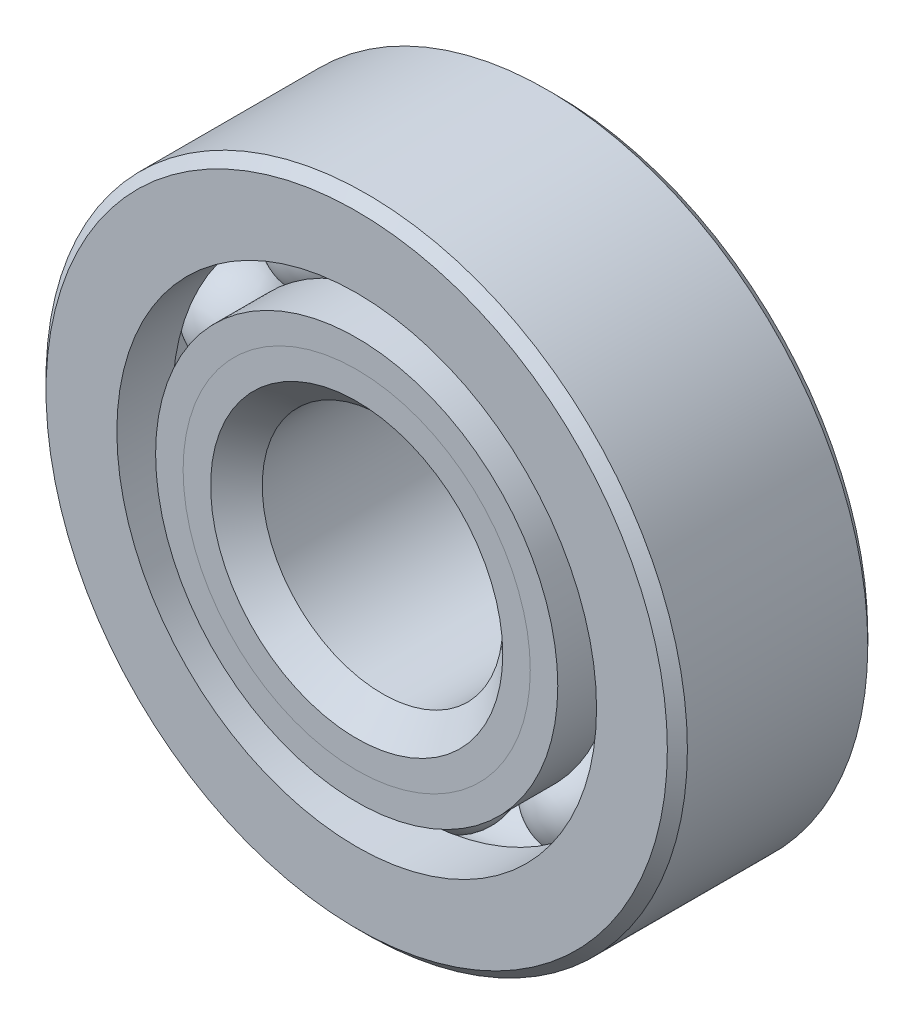
ISO-10303-21;
HEADER;
FILE_DESCRIPTION(('STEP AP214'),'2;1');
FILE_NAME('part.step','',(''),(''),'','','');
FILE_SCHEMA(('AUTOMOTIVE_DESIGN { 1 0 10303 214 1 1 1 1 }'));
ENDSEC;
DATA;
#1=APPLICATION_CONTEXT('core data for automotive mechanical design processes');
#2=APPLICATION_PROTOCOL_DEFINITION('international standard','automotive_design',2000,#1);
#3=PRODUCT_CONTEXT('',#1,'mechanical');
#4=PRODUCT('Part','Part','',(#3));
#5=PRODUCT_RELATED_PRODUCT_CATEGORY('part','',(#4));
#6=PRODUCT_DEFINITION_FORMATION('','',#4);
#7=PRODUCT_DEFINITION_CONTEXT('part definition',#1,'design');
#8=PRODUCT_DEFINITION('design','',#6,#7);
#9=PRODUCT_DEFINITION_SHAPE('','',#8);
#10=(LENGTH_UNIT() NAMED_UNIT(*) SI_UNIT(.MILLI.,.METRE.));
#11=(NAMED_UNIT(*) PLANE_ANGLE_UNIT() SI_UNIT($,.RADIAN.));
#12=(NAMED_UNIT(*) SI_UNIT($,.STERADIAN.) SOLID_ANGLE_UNIT());
#13=UNCERTAINTY_MEASURE_WITH_UNIT(LENGTH_MEASURE(1.E-05),#10,'distance_accuracy_value','');
#14=(GEOMETRIC_REPRESENTATION_CONTEXT(3) GLOBAL_UNCERTAINTY_ASSIGNED_CONTEXT((#13)) GLOBAL_UNIT_ASSIGNED_CONTEXT((#10,
#11,#12)) REPRESENTATION_CONTEXT('',''));
#15=CARTESIAN_POINT('',(0.,0.,0.));
#16=DIRECTION('',(0.,0.,1.));
#17=DIRECTION('',(1.,0.,0.));
#18=AXIS2_PLACEMENT_3D('',#15,#16,#17);
#19=CARTESIAN_POINT('',(-2.56604999203928,3.53186481606816,0.));
#20=DIRECTION('',(0.,0.,1.));
#21=DIRECTION('',(-0.587785252292462,0.809016994374955,0.));
#22=AXIS2_PLACEMENT_3D('',#19,#20,#21);
#23=SPHERICAL_SURFACE('',#22,0.961832467237322);
#24=CARTESIAN_POINT('',(-2.56604999203928,3.53186481606816,0.96183246723732));
#25=VERTEX_POINT('',#24);
#26=VERTEX_LOOP('',#25);
#27=FACE_BOUND('',#26,.T.);
#28=ADVANCED_FACE('F39',(#27),#23,.T.);
#29=CLOSED_SHELL('',(#28));
#30=MANIFOLD_SOLID_BREP('B2',#29);
#31=CARTESIAN_POINT('',(-4.15195610395102,1.34905231606818,0.));
#32=DIRECTION('',(0.,0.,1.));
#33=DIRECTION('',(-0.95105651629515,0.309016994374958,0.));
#34=AXIS2_PLACEMENT_3D('',#31,#32,#33);
#35=SPHERICAL_SURFACE('',#34,0.961832467237322);
#36=CARTESIAN_POINT('',(-4.15195610395102,1.34905231606818,0.96183246723732));
#37=VERTEX_POINT('',#36);
#38=VERTEX_LOOP('',#37);
#39=FACE_BOUND('',#38,.T.);
#40=ADVANCED_FACE('F72',(#39),#35,.T.);
#41=CLOSED_SHELL('',(#40));
#42=MANIFOLD_SOLID_BREP('B6',#41);
#43=CARTESIAN_POINT('',(-4.15195610395104,-1.34905231606809,0.));
#44=DIRECTION('',(0.,0.,1.));
#45=DIRECTION('',(-0.951056516295157,-0.309016994374938,0.));
#46=AXIS2_PLACEMENT_3D('',#43,#44,#45);
#47=SPHERICAL_SURFACE('',#46,0.961832467237322);
#48=CARTESIAN_POINT('',(-4.15195610395104,-1.34905231606809,0.96183246723732));
#49=VERTEX_POINT('',#48);
#50=VERTEX_LOOP('',#49);
#51=FACE_BOUND('',#50,.T.);
#52=ADVANCED_FACE('F105',(#51),#47,.T.);
#53=CLOSED_SHELL('',(#52));
#54=MANIFOLD_SOLID_BREP('B35',#53);
#55=CARTESIAN_POINT('',(-2.56604999203936,-3.53186481606811,0.));
#56=DIRECTION('',(0.,0.,1.));
#57=DIRECTION('',(-0.58778525229248,-0.809016994374942,0.));
#58=AXIS2_PLACEMENT_3D('',#55,#56,#57);
#59=SPHERICAL_SURFACE('',#58,0.961832467237322);
#60=CARTESIAN_POINT('',(-2.56604999203936,-3.53186481606811,0.96183246723732));
#61=VERTEX_POINT('',#60);
#62=VERTEX_LOOP('',#61);
#63=FACE_BOUND('',#62,.T.);
#64=ADVANCED_FACE('F138',(#63),#59,.T.);
#65=CLOSED_SHELL('',(#64));
#66=MANIFOLD_SOLID_BREP('B68',#65);
#67=CARTESIAN_POINT('',(0.,-4.365625,0.));
#68=DIRECTION('',(0.,0.,1.));
#69=DIRECTION('',(0.,-1.,0.));
#70=AXIS2_PLACEMENT_3D('',#67,#68,#69);
#71=SPHERICAL_SURFACE('',#70,0.961832467237322);
#72=CARTESIAN_POINT('',(0.,-4.365625,0.96183246723732));
#73=VERTEX_POINT('',#72);
#74=VERTEX_LOOP('',#73);
#75=FACE_BOUND('',#74,.T.);
#76=ADVANCED_FACE('F171',(#75),#71,.T.);
#77=CLOSED_SHELL('',(#76));
#78=MANIFOLD_SOLID_BREP('B101',#77);
#79=CARTESIAN_POINT('',(2.56604999203931,-3.53186481606815,0.));
#80=DIRECTION('',(0.,0.,1.));
#81=DIRECTION('',(0.587785252292469,-0.809016994374951,0.));
#82=AXIS2_PLACEMENT_3D('',#79,#80,#81);
#83=SPHERICAL_SURFACE('',#82,0.961832467237322);
#84=CARTESIAN_POINT('',(2.56604999203931,-3.53186481606815,0.96183246723732));
#85=VERTEX_POINT('',#84);
#86=VERTEX_LOOP('',#85);
#87=FACE_BOUND('',#86,.T.);
#88=ADVANCED_FACE('F204',(#87),#83,.T.);
#89=CLOSED_SHELL('',(#88));
#90=MANIFOLD_SOLID_BREP('B134',#89);
#91=CARTESIAN_POINT('',(4.15195610395103,-1.34905231606815,0.));
#92=DIRECTION('',(0.,0.,1.));
#93=DIRECTION('',(0.951056516295152,-0.309016994374952,0.));
#94=AXIS2_PLACEMENT_3D('',#91,#92,#93);
#95=SPHERICAL_SURFACE('',#94,0.961832467237322);
#96=CARTESIAN_POINT('',(4.15195610395103,-1.34905231606815,0.96183246723732));
#97=VERTEX_POINT('',#96);
#98=VERTEX_LOOP('',#97);
#99=FACE_BOUND('',#98,.T.);
#100=ADVANCED_FACE('F237',(#99),#95,.T.);
#101=CLOSED_SHELL('',(#100));
#102=MANIFOLD_SOLID_BREP('B167',#101);
#103=CARTESIAN_POINT('',(4.15195610395104,1.34905231606812,0.));
#104=DIRECTION('',(0.,0.,1.));
#105=DIRECTION('',(0.951056516295155,0.309016994374945,0.));
#106=AXIS2_PLACEMENT_3D('',#103,#104,#105);
#107=SPHERICAL_SURFACE('',#106,0.961832467237322);
#108=CARTESIAN_POINT('',(4.15195610395104,1.34905231606812,0.96183246723732));
#109=VERTEX_POINT('',#108);
#110=VERTEX_LOOP('',#109);
#111=FACE_BOUND('',#110,.T.);
#112=ADVANCED_FACE('F270',(#111),#107,.T.);
#113=CLOSED_SHELL('',(#112));
#114=MANIFOLD_SOLID_BREP('B200',#113);
#115=CARTESIAN_POINT('',(2.56604999203933,3.53186481606813,0.));
#116=DIRECTION('',(0.,0.,1.));
#117=DIRECTION('',(0.587785252292474,0.809016994374947,0.));
#118=AXIS2_PLACEMENT_3D('',#115,#116,#117);
#119=SPHERICAL_SURFACE('',#118,0.961832467237322);
#120=CARTESIAN_POINT('',(2.56604999203933,3.53186481606813,0.96183246723732));
#121=VERTEX_POINT('',#120);
#122=VERTEX_LOOP('',#121);
#123=FACE_BOUND('',#122,.T.);
#124=ADVANCED_FACE('F303',(#123),#119,.T.);
#125=CLOSED_SHELL('',(#124));
#126=MANIFOLD_SOLID_BREP('B233',#125);
#127=CARTESIAN_POINT('',(0.,4.365625,0.));
#128=DIRECTION('',(0.,0.,1.));
#129=DIRECTION('',(0.,1.,0.));
#130=AXIS2_PLACEMENT_3D('',#127,#128,#129);
#131=SPHERICAL_SURFACE('',#130,0.961832467237322);
#132=CARTESIAN_POINT('',(0.,4.365625,0.96183246723732));
#133=VERTEX_POINT('',#132);
#134=VERTEX_LOOP('',#133);
#135=FACE_BOUND('',#134,.T.);
#136=ADVANCED_FACE('F338',(#135),#131,.T.);
#137=CLOSED_SHELL('',(#136));
#138=MANIFOLD_SOLID_BREP('B266',#137);
#139=CARTESIAN_POINT('',(0.,3.43717752879507,1.984375));
#140=DIRECTION('',(0.,0.,-1.));
#141=DIRECTION('',(-1.,0.,0.));
#142=AXIS2_PLACEMENT_3D('',#139,#140,#141);
#143=PLANE('',#142);
#144=CARTESIAN_POINT('',(0.,0.,1.984375));
#145=DIRECTION('',(0.,0.,1.));
#146=DIRECTION('',(1.,0.,0.));
#147=AXIS2_PLACEMENT_3D('',#144,#145,#146);
#148=CIRCLE('',#147,2.89252126638134);
#149=CARTESIAN_POINT('',(2.89252126638134,0.,1.984375));
#150=VERTEX_POINT('',#149);
#151=EDGE_CURVE('E392',#150,#150,#148,.T.);
#152=ORIENTED_EDGE('',*,*,#151,.F.);
#153=EDGE_LOOP('',(#152));
#154=FACE_BOUND('',#153,.T.);
#155=CARTESIAN_POINT('',(0.,0.,1.984375));
#156=DIRECTION('',(0.,0.,1.));
#157=DIRECTION('',(1.,0.,0.));
#158=AXIS2_PLACEMENT_3D('',#155,#156,#157);
#159=CIRCLE('',#158,3.43717752879507);
#160=CARTESIAN_POINT('',(3.43717752879507,0.,1.984375));
#161=VERTEX_POINT('',#160);
#162=EDGE_CURVE('E337',#161,#161,#159,.T.);
#163=ORIENTED_EDGE('',*,*,#162,.T.);
#164=EDGE_LOOP('',(#163));
#165=FACE_BOUND('',#164,.T.);
#166=ADVANCED_FACE('F358',(#154,#165),#143,.F.);
#167=CARTESIAN_POINT('',(0.,0.,1.43971873758627));
#168=DIRECTION('',(0.,0.,1.));
#169=DIRECTION('',(1.,0.,0.));
#170=AXIS2_PLACEMENT_3D('',#167,#168,#169);
#171=CONICAL_SURFACE('',#170,2.89252126638134,0.785398163397451);
#172=ORIENTED_EDGE('',*,*,#162,.F.);
#173=EDGE_LOOP('',(#172));
#174=FACE_BOUND('',#173,.T.);
#175=CARTESIAN_POINT('',(0.,0.,1.43971873758627));
#176=DIRECTION('',(0.,0.,1.));
#177=DIRECTION('',(1.,0.,0.));
#178=AXIS2_PLACEMENT_3D('',#175,#176,#177);
#179=CIRCLE('',#178,2.89252126638134);
#180=CARTESIAN_POINT('',(2.89252126638134,0.,1.43971873758627));
#181=VERTEX_POINT('',#180);
#182=EDGE_CURVE('E364',#181,#181,#179,.T.);
#183=ORIENTED_EDGE('',*,*,#182,.T.);
#184=EDGE_LOOP('',(#183));
#185=FACE_BOUND('',#184,.T.);
#186=ADVANCED_FACE('F399',(#174,#185),#171,.T.);
#187=CARTESIAN_POINT('',(0.,0.,1.984375));
#188=DIRECTION('',(0.,0.,1.));
#189=DIRECTION('',(1.,0.,0.));
#190=AXIS2_PLACEMENT_3D('',#187,#188,#189);
#191=CYLINDRICAL_SURFACE('',#190,2.89252126638134);
#192=ORIENTED_EDGE('',*,*,#182,.F.);
#193=EDGE_LOOP('',(#192));
#194=FACE_BOUND('',#193,.T.);
#195=CARTESIAN_POINT('',(0.,0.,0.));
#196=DIRECTION('',(0.,0.,1.));
#197=DIRECTION('',(1.,0.,0.));
#198=AXIS2_PLACEMENT_3D('',#195,#196,#197);
#199=CIRCLE('',#198,2.89252126638134);
#200=CARTESIAN_POINT('',(2.89252126638134,0.,0.));
#201=VERTEX_POINT('',#200);
#202=EDGE_CURVE('E368',#201,#201,#199,.T.);
#203=ORIENTED_EDGE('',*,*,#202,.T.);
#204=EDGE_LOOP('',(#203));
#205=FACE_BOUND('',#204,.T.);
#206=ADVANCED_FACE('F403',(#194,#205),#191,.T.);
#207=CARTESIAN_POINT('',(0.,2.89252126638134,0.));
#208=DIRECTION('',(0.,0.,-1.));
#209=DIRECTION('',(-1.,0.,0.));
#210=AXIS2_PLACEMENT_3D('',#207,#208,#209);
#211=PLANE('',#210);
#212=ORIENTED_EDGE('',*,*,#202,.F.);
#213=EDGE_LOOP('',(#212));
#214=FACE_BOUND('',#213,.T.);
#215=CARTESIAN_POINT('',(0.,0.,0.));
#216=DIRECTION('',(0.,0.,1.));
#217=DIRECTION('',(1.,0.,0.));
#218=AXIS2_PLACEMENT_3D('',#215,#216,#217);
#219=CIRCLE('',#218,3.40379253276268);
#220=CARTESIAN_POINT('',(3.40379253276268,0.,0.));
#221=VERTEX_POINT('',#220);
#222=EDGE_CURVE('E372',#221,#221,#219,.T.);
#223=ORIENTED_EDGE('',*,*,#222,.T.);
#224=EDGE_LOOP('',(#223));
#225=FACE_BOUND('',#224,.T.);
#226=ADVANCED_FACE('F408',(#214,#225),#211,.F.);
#227=CARTESIAN_POINT('',(0.,0.,0.));
#228=DIRECTION('',(0.,0.,1.));
#229=DIRECTION('',(1.,0.,0.));
#230=AXIS2_PLACEMENT_3D('',#227,#228,#229);
#231=TOROIDAL_SURFACE('',#230,4.365625,0.96183246723732);
#232=ORIENTED_EDGE('',*,*,#222,.F.);
#233=EDGE_LOOP('',(#232));
#234=FACE_BOUND('',#233,.T.);
#235=CARTESIAN_POINT('',(0.,0.,-0.881944444444445));
#236=DIRECTION('',(0.,0.,1.));
#237=DIRECTION('',(1.,0.,0.));
#238=AXIS2_PLACEMENT_3D('',#235,#236,#237);
#239=CIRCLE('',#238,3.9818337912088);
#240=CARTESIAN_POINT('',(3.9818337912088,0.,-0.881944444444445));
#241=VERTEX_POINT('',#240);
#242=EDGE_CURVE('E377',#241,#241,#239,.T.);
#243=ORIENTED_EDGE('',*,*,#242,.T.);
#244=EDGE_LOOP('',(#243));
#245=FACE_BOUND('',#244,.T.);
#246=ADVANCED_FACE('F414',(#234,#245),#231,.F.);
#247=CARTESIAN_POINT('',(0.,0.,1.984375));
#248=DIRECTION('',(0.,0.,1.));
#249=DIRECTION('',(1.,0.,0.));
#250=AXIS2_PLACEMENT_3D('',#247,#248,#249);
#251=CYLINDRICAL_SURFACE('',#250,3.9818337912088);
#252=ORIENTED_EDGE('',*,*,#242,.F.);
#253=EDGE_LOOP('',(#252));
#254=FACE_BOUND('',#253,.T.);
#255=CARTESIAN_POINT('',(0.,0.,-1.98437500000001));
#256=DIRECTION('',(0.,0.,1.));
#257=DIRECTION('',(1.,0.,0.));
#258=AXIS2_PLACEMENT_3D('',#255,#256,#257);
#259=CIRCLE('',#258,3.9818337912088);
#260=CARTESIAN_POINT('',(3.9818337912088,0.,-1.98437500000001));
#261=VERTEX_POINT('',#260);
#262=EDGE_CURVE('E380',#261,#261,#259,.T.);
#263=ORIENTED_EDGE('',*,*,#262,.T.);
#264=EDGE_LOOP('',(#263));
#265=FACE_BOUND('',#264,.T.);
#266=ADVANCED_FACE('F418',(#254,#265),#251,.T.);
#267=CARTESIAN_POINT('',(0.,2.5796875,-1.98437500000001));
#268=DIRECTION('',(0.,0.,1.));
#269=DIRECTION('',(1.,0.,0.));
#270=AXIS2_PLACEMENT_3D('',#267,#268,#269);
#271=PLANE('',#270);
#272=ORIENTED_EDGE('',*,*,#262,.F.);
#273=EDGE_LOOP('',(#272));
#274=FACE_BOUND('',#273,.T.);
#275=CARTESIAN_POINT('',(0.,0.,-1.98437500000001));
#276=DIRECTION('',(0.,0.,1.));
#277=DIRECTION('',(1.,0.,0.));
#278=AXIS2_PLACEMENT_3D('',#275,#276,#277);
#279=CIRCLE('',#278,2.5796875);
#280=CARTESIAN_POINT('',(2.5796875,0.,-1.98437500000001));
#281=VERTEX_POINT('',#280);
#282=EDGE_CURVE('E383',#281,#281,#279,.T.);
#283=ORIENTED_EDGE('',*,*,#282,.T.);
#284=EDGE_LOOP('',(#283));
#285=FACE_BOUND('',#284,.T.);
#286=ADVANCED_FACE('F422',(#274,#285),#271,.F.);
#287=CARTESIAN_POINT('',(0.,0.,-1.78593750000001));
#288=DIRECTION('',(0.,0.,-1.));
#289=DIRECTION('',(-1.,0.,0.));
#290=AXIS2_PLACEMENT_3D('',#287,#288,#289);
#291=CONICAL_SURFACE('',#290,2.38125,0.785398163397446);
#292=ORIENTED_EDGE('',*,*,#282,.F.);
#293=EDGE_LOOP('',(#292));
#294=FACE_BOUND('',#293,.T.);
#295=CARTESIAN_POINT('',(0.,0.,-1.78593750000001));
#296=DIRECTION('',(0.,0.,1.));
#297=DIRECTION('',(1.,0.,0.));
#298=AXIS2_PLACEMENT_3D('',#295,#296,#297);
#299=CIRCLE('',#298,2.38125);
#300=CARTESIAN_POINT('',(2.38125,0.,-1.78593750000001));
#301=VERTEX_POINT('',#300);
#302=EDGE_CURVE('E386',#301,#301,#299,.T.);
#303=ORIENTED_EDGE('',*,*,#302,.T.);
#304=EDGE_LOOP('',(#303));
#305=FACE_BOUND('',#304,.T.);
#306=ADVANCED_FACE('F426',(#294,#305),#291,.F.);
#307=CARTESIAN_POINT('',(0.,0.,1.984375));
#308=DIRECTION('',(0.,0.,1.));
#309=DIRECTION('',(1.,0.,0.));
#310=AXIS2_PLACEMENT_3D('',#307,#308,#309);
#311=CYLINDRICAL_SURFACE('',#310,2.38125);
#312=ORIENTED_EDGE('',*,*,#302,.F.);
#313=EDGE_LOOP('',(#312));
#314=FACE_BOUND('',#313,.T.);
#315=CARTESIAN_POINT('',(0.,0.,1.47310373361866));
#316=DIRECTION('',(0.,0.,1.));
#317=DIRECTION('',(1.,0.,0.));
#318=AXIS2_PLACEMENT_3D('',#315,#316,#317);
#319=CIRCLE('',#318,2.38125);
#320=CARTESIAN_POINT('',(2.38125,0.,1.47310373361866));
#321=VERTEX_POINT('',#320);
#322=EDGE_CURVE('E389',#321,#321,#319,.T.);
#323=ORIENTED_EDGE('',*,*,#322,.T.);
#324=EDGE_LOOP('',(#323));
#325=FACE_BOUND('',#324,.T.);
#326=ADVANCED_FACE('F430',(#314,#325),#311,.F.);
#327=CARTESIAN_POINT('',(0.,0.,1.984375));
#328=DIRECTION('',(0.,0.,1.));
#329=DIRECTION('',(1.,0.,0.));
#330=AXIS2_PLACEMENT_3D('',#327,#328,#329);
#331=CONICAL_SURFACE('',#330,2.89252126638134,0.785398163397451);
#332=ORIENTED_EDGE('',*,*,#322,.F.);
#333=EDGE_LOOP('',(#332));
#334=FACE_BOUND('',#333,.T.);
#335=ORIENTED_EDGE('',*,*,#151,.T.);
#336=EDGE_LOOP('',(#335));
#337=FACE_BOUND('',#336,.T.);
#338=ADVANCED_FACE('F396',(#334,#337),#331,.F.);
#339=CLOSED_SHELL('',(#166,#186,#206,#226,#246,#266,#286,#306,#326,#338));
#340=MANIFOLD_SOLID_BREP('B299',#339);
#341=CARTESIAN_POINT('',(0.,3.9818337912088,1.984375));
#342=DIRECTION('',(0.,0.,-1.));
#343=DIRECTION('',(-1.,0.,0.));
#344=AXIS2_PLACEMENT_3D('',#341,#342,#343);
#345=PLANE('',#344);
#346=CARTESIAN_POINT('',(0.,0.,1.984375));
#347=DIRECTION('',(0.,0.,1.));
#348=DIRECTION('',(1.,0.,0.));
#349=AXIS2_PLACEMENT_3D('',#346,#347,#348);
#350=CIRCLE('',#349,3.43717752879507);
#351=CARTESIAN_POINT('',(3.43717752879507,0.,1.984375));
#352=VERTEX_POINT('',#351);
#353=EDGE_CURVE('E357',#352,#352,#350,.T.);
#354=ORIENTED_EDGE('',*,*,#353,.F.);
#355=EDGE_LOOP('',(#354));
#356=FACE_BOUND('',#355,.T.);
#357=CARTESIAN_POINT('',(0.,0.,1.984375));
#358=DIRECTION('',(0.,0.,1.));
#359=DIRECTION('',(1.,0.,0.));
#360=AXIS2_PLACEMENT_3D('',#357,#358,#359);
#361=CIRCLE('',#360,3.9818337912088);
#362=CARTESIAN_POINT('',(3.9818337912088,0.,1.984375));
#363=VERTEX_POINT('',#362);
#364=EDGE_CURVE('E538',#363,#363,#361,.T.);
#365=ORIENTED_EDGE('',*,*,#364,.T.);
#366=EDGE_LOOP('',(#365));
#367=FACE_BOUND('',#366,.T.);
#368=ADVANCED_FACE('F516',(#356,#367),#345,.F.);
#369=CARTESIAN_POINT('',(0.,0.,1.984375));
#370=DIRECTION('',(0.,0.,1.));
#371=DIRECTION('',(1.,0.,0.));
#372=AXIS2_PLACEMENT_3D('',#369,#370,#371);
#373=CONICAL_SURFACE('',#372,3.43717752879507,0.785398163397451);
#374=CARTESIAN_POINT('',(0.,0.,1.43971873758627));
#375=DIRECTION('',(0.,0.,1.));
#376=DIRECTION('',(1.,0.,0.));
#377=AXIS2_PLACEMENT_3D('',#374,#375,#376);
#378=CIRCLE('',#377,2.89252126638134);
#379=CARTESIAN_POINT('',(2.89252126638134,0.,1.43971873758627));
#380=VERTEX_POINT('',#379);
#381=EDGE_CURVE('E522',#380,#380,#378,.T.);
#382=ORIENTED_EDGE('',*,*,#381,.F.);
#383=EDGE_LOOP('',(#382));
#384=FACE_BOUND('',#383,.T.);
#385=ORIENTED_EDGE('',*,*,#353,.T.);
#386=EDGE_LOOP('',(#385));
#387=FACE_BOUND('',#386,.T.);
#388=ADVANCED_FACE('F563',(#384,#387),#373,.F.);
#389=CARTESIAN_POINT('',(0.,0.,1.984375));
#390=DIRECTION('',(0.,0.,1.));
#391=DIRECTION('',(1.,0.,0.));
#392=AXIS2_PLACEMENT_3D('',#389,#390,#391);
#393=CYLINDRICAL_SURFACE('',#392,2.89252126638134);
#394=CARTESIAN_POINT('',(0.,0.,0.));
#395=DIRECTION('',(0.,0.,1.));
#396=DIRECTION('',(1.,0.,0.));
#397=AXIS2_PLACEMENT_3D('',#394,#395,#396);
#398=CIRCLE('',#397,2.89252126638134);
#399=CARTESIAN_POINT('',(2.89252126638134,0.,0.));
#400=VERTEX_POINT('',#399);
#401=EDGE_CURVE('E526',#400,#400,#398,.T.);
#402=ORIENTED_EDGE('',*,*,#401,.F.);
#403=EDGE_LOOP('',(#402));
#404=FACE_BOUND('',#403,.T.);
#405=ORIENTED_EDGE('',*,*,#381,.T.);
#406=EDGE_LOOP('',(#405));
#407=FACE_BOUND('',#406,.T.);
#408=ADVANCED_FACE('F558',(#404,#407),#393,.F.);
#409=CARTESIAN_POINT('',(0.,2.89252126638134,0.));
#410=DIRECTION('',(0.,0.,1.));
#411=DIRECTION('',(1.,0.,0.));
#412=AXIS2_PLACEMENT_3D('',#409,#410,#411);
#413=PLANE('',#412);
#414=CARTESIAN_POINT('',(0.,0.,0.));
#415=DIRECTION('',(0.,0.,1.));
#416=DIRECTION('',(1.,0.,0.));
#417=AXIS2_PLACEMENT_3D('',#414,#415,#416);
#418=CIRCLE('',#417,3.40379253276268);
#419=CARTESIAN_POINT('',(3.40379253276268,0.,0.));
#420=VERTEX_POINT('',#419);
#421=EDGE_CURVE('E530',#420,#420,#418,.T.);
#422=ORIENTED_EDGE('',*,*,#421,.F.);
#423=EDGE_LOOP('',(#422));
#424=FACE_BOUND('',#423,.T.);
#425=ORIENTED_EDGE('',*,*,#401,.T.);
#426=EDGE_LOOP('',(#425));
#427=FACE_BOUND('',#426,.T.);
#428=ADVANCED_FACE('F552',(#424,#427),#413,.F.);
#429=CARTESIAN_POINT('',(0.,0.,0.));
#430=DIRECTION('',(0.,0.,1.));
#431=DIRECTION('',(1.,0.,0.));
#432=AXIS2_PLACEMENT_3D('',#429,#430,#431);
#433=TOROIDAL_SURFACE('',#432,4.365625,0.961832467237322);
#434=CARTESIAN_POINT('',(0.,0.,0.881944444444442));
#435=DIRECTION('',(0.,0.,1.));
#436=DIRECTION('',(1.,0.,0.));
#437=AXIS2_PLACEMENT_3D('',#434,#435,#436);
#438=CIRCLE('',#437,3.9818337912088);
#439=CARTESIAN_POINT('',(3.9818337912088,0.,0.881944444444442));
#440=VERTEX_POINT('',#439);
#441=EDGE_CURVE('E535',#440,#440,#438,.T.);
#442=ORIENTED_EDGE('',*,*,#441,.F.);
#443=EDGE_LOOP('',(#442));
#444=FACE_BOUND('',#443,.T.);
#445=ORIENTED_EDGE('',*,*,#421,.T.);
#446=EDGE_LOOP('',(#445));
#447=FACE_BOUND('',#446,.T.);
#448=ADVANCED_FACE('F546',(#444,#447),#433,.F.);
#449=CARTESIAN_POINT('',(0.,0.,1.984375));
#450=DIRECTION('',(0.,0.,1.));
#451=DIRECTION('',(1.,0.,0.));
#452=AXIS2_PLACEMENT_3D('',#449,#450,#451);
#453=CYLINDRICAL_SURFACE('',#452,3.9818337912088);
#454=ORIENTED_EDGE('',*,*,#364,.F.);
#455=EDGE_LOOP('',(#454));
#456=FACE_BOUND('',#455,.T.);
#457=ORIENTED_EDGE('',*,*,#441,.T.);
#458=EDGE_LOOP('',(#457));
#459=FACE_BOUND('',#458,.T.);
#460=ADVANCED_FACE('F543',(#456,#459),#453,.T.);
#461=CLOSED_SHELL('',(#368,#388,#408,#428,#448,#460));
#462=MANIFOLD_SOLID_BREP('B332',#461);
#463=CARTESIAN_POINT('',(0.,0.,1.7859375));
#464=DIRECTION('',(0.,0.,-1.));
#465=DIRECTION('',(-1.,0.,0.));
#466=AXIS2_PLACEMENT_3D('',#463,#464,#465);
#467=CONICAL_SURFACE('',#466,6.35,0.785398163397447);
#468=CARTESIAN_POINT('',(0.,0.,1.984375));
#469=DIRECTION('',(0.,0.,1.));
#470=DIRECTION('',(1.,0.,0.));
#471=AXIS2_PLACEMENT_3D('',#468,#469,#470);
#472=CIRCLE('',#471,6.1515625);
#473=CARTESIAN_POINT('',(6.1515625,0.,1.984375));
#474=VERTEX_POINT('',#473);
#475=EDGE_CURVE('E635',#474,#474,#472,.T.);
#476=ORIENTED_EDGE('',*,*,#475,.F.);
#477=EDGE_LOOP('',(#476));
#478=FACE_BOUND('',#477,.T.);
#479=CARTESIAN_POINT('',(0.,0.,1.7859375));
#480=DIRECTION('',(0.,0.,1.));
#481=DIRECTION('',(1.,0.,0.));
#482=AXIS2_PLACEMENT_3D('',#479,#480,#481);
#483=CIRCLE('',#482,6.35);
#484=CARTESIAN_POINT('',(6.35,0.,1.7859375));
#485=VERTEX_POINT('',#484);
#486=EDGE_CURVE('E515',#485,#485,#483,.T.);
#487=ORIENTED_EDGE('',*,*,#486,.T.);
#488=EDGE_LOOP('',(#487));
#489=FACE_BOUND('',#488,.T.);
#490=ADVANCED_FACE('F607',(#478,#489),#467,.T.);
#491=CARTESIAN_POINT('',(0.,0.,1.984375));
#492=DIRECTION('',(0.,0.,1.));
#493=DIRECTION('',(1.,0.,0.));
#494=AXIS2_PLACEMENT_3D('',#491,#492,#493);
#495=CYLINDRICAL_SURFACE('',#494,6.35);
#496=ORIENTED_EDGE('',*,*,#486,.F.);
#497=EDGE_LOOP('',(#496));
#498=FACE_BOUND('',#497,.T.);
#499=CARTESIAN_POINT('',(0.,0.,-1.78593750000001));
#500=DIRECTION('',(0.,0.,1.));
#501=DIRECTION('',(1.,0.,0.));
#502=AXIS2_PLACEMENT_3D('',#499,#500,#501);
#503=CIRCLE('',#502,6.35);
#504=CARTESIAN_POINT('',(6.35,0.,-1.78593750000001));
#505=VERTEX_POINT('',#504);
#506=EDGE_CURVE('E613',#505,#505,#503,.T.);
#507=ORIENTED_EDGE('',*,*,#506,.T.);
#508=EDGE_LOOP('',(#507));
#509=FACE_BOUND('',#508,.T.);
#510=ADVANCED_FACE('F642',(#498,#509),#495,.T.);
#511=CARTESIAN_POINT('',(0.,0.,-1.98437500000001));
#512=DIRECTION('',(0.,0.,1.));
#513=DIRECTION('',(1.,0.,0.));
#514=AXIS2_PLACEMENT_3D('',#511,#512,#513);
#515=CONICAL_SURFACE('',#514,6.1515625,0.785398163397446);
#516=ORIENTED_EDGE('',*,*,#506,.F.);
#517=EDGE_LOOP('',(#516));
#518=FACE_BOUND('',#517,.T.);
#519=CARTESIAN_POINT('',(0.,0.,-1.98437500000001));
#520=DIRECTION('',(0.,0.,1.));
#521=DIRECTION('',(1.,0.,0.));
#522=AXIS2_PLACEMENT_3D('',#519,#520,#521);
#523=CIRCLE('',#522,6.1515625);
#524=CARTESIAN_POINT('',(6.1515625,0.,-1.98437500000001));
#525=VERTEX_POINT('',#524);
#526=EDGE_CURVE('E617',#525,#525,#523,.T.);
#527=ORIENTED_EDGE('',*,*,#526,.T.);
#528=EDGE_LOOP('',(#527));
#529=FACE_BOUND('',#528,.T.);
#530=ADVANCED_FACE('F646',(#518,#529),#515,.T.);
#531=CARTESIAN_POINT('',(0.,6.1515625,-1.984375));
#532=DIRECTION('',(0.,0.,1.));
#533=DIRECTION('',(1.,0.,0.));
#534=AXIS2_PLACEMENT_3D('',#531,#532,#533);
#535=PLANE('',#534);
#536=ORIENTED_EDGE('',*,*,#526,.F.);
#537=EDGE_LOOP('',(#536));
#538=FACE_BOUND('',#537,.T.);
#539=CARTESIAN_POINT('',(0.,0.,-1.984375));
#540=DIRECTION('',(0.,0.,1.));
#541=DIRECTION('',(1.,0.,0.));
#542=AXIS2_PLACEMENT_3D('',#539,#540,#541);
#543=CIRCLE('',#542,4.74941620879121);
#544=CARTESIAN_POINT('',(4.74941620879121,0.,-1.984375));
#545=VERTEX_POINT('',#544);
#546=EDGE_CURVE('E621',#545,#545,#543,.T.);
#547=ORIENTED_EDGE('',*,*,#546,.T.);
#548=EDGE_LOOP('',(#547));
#549=FACE_BOUND('',#548,.T.);
#550=ADVANCED_FACE('F651',(#538,#549),#535,.F.);
#551=CARTESIAN_POINT('',(0.,0.,1.984375));
#552=DIRECTION('',(0.,0.,1.));
#553=DIRECTION('',(1.,0.,0.));
#554=AXIS2_PLACEMENT_3D('',#551,#552,#553);
#555=CYLINDRICAL_SURFACE('',#554,4.74941620879121);
#556=ORIENTED_EDGE('',*,*,#546,.F.);
#557=EDGE_LOOP('',(#556));
#558=FACE_BOUND('',#557,.T.);
#559=CARTESIAN_POINT('',(0.,0.,-0.881944444444447));
#560=DIRECTION('',(0.,0.,1.));
#561=DIRECTION('',(1.,0.,0.));
#562=AXIS2_PLACEMENT_3D('',#559,#560,#561);
#563=CIRCLE('',#562,4.74941620879121);
#564=CARTESIAN_POINT('',(4.74941620879121,0.,-0.881944444444447));
#565=VERTEX_POINT('',#564);
#566=EDGE_CURVE('E626',#565,#565,#563,.T.);
#567=ORIENTED_EDGE('',*,*,#566,.T.);
#568=EDGE_LOOP('',(#567));
#569=FACE_BOUND('',#568,.T.);
#570=ADVANCED_FACE('F657',(#558,#569),#555,.F.);
#571=CARTESIAN_POINT('',(0.,0.,0.));
#572=DIRECTION('',(0.,0.,1.));
#573=DIRECTION('',(1.,0.,0.));
#574=AXIS2_PLACEMENT_3D('',#571,#572,#573);
#575=TOROIDAL_SURFACE('',#574,4.365625,0.961832467237322);
#576=ORIENTED_EDGE('',*,*,#566,.F.);
#577=EDGE_LOOP('',(#576));
#578=FACE_BOUND('',#577,.T.);
#579=CARTESIAN_POINT('',(0.,0.,0.881944444444442));
#580=DIRECTION('',(0.,0.,1.));
#581=DIRECTION('',(1.,0.,0.));
#582=AXIS2_PLACEMENT_3D('',#579,#580,#581);
#583=CIRCLE('',#582,4.74941620879121);
#584=CARTESIAN_POINT('',(4.74941620879121,0.,0.881944444444442));
#585=VERTEX_POINT('',#584);
#586=EDGE_CURVE('E629',#585,#585,#583,.T.);
#587=ORIENTED_EDGE('',*,*,#586,.T.);
#588=EDGE_LOOP('',(#587));
#589=FACE_BOUND('',#588,.T.);
#590=ADVANCED_FACE('F661',(#578,#589),#575,.F.);
#591=CARTESIAN_POINT('',(0.,0.,1.984375));
#592=DIRECTION('',(0.,0.,1.));
#593=DIRECTION('',(1.,0.,0.));
#594=AXIS2_PLACEMENT_3D('',#591,#592,#593);
#595=CYLINDRICAL_SURFACE('',#594,4.74941620879121);
#596=ORIENTED_EDGE('',*,*,#586,.F.);
#597=EDGE_LOOP('',(#596));
#598=FACE_BOUND('',#597,.T.);
#599=CARTESIAN_POINT('',(0.,0.,1.984375));
#600=DIRECTION('',(0.,0.,1.));
#601=DIRECTION('',(1.,0.,0.));
#602=AXIS2_PLACEMENT_3D('',#599,#600,#601);
#603=CIRCLE('',#602,4.74941620879121);
#604=CARTESIAN_POINT('',(4.74941620879121,0.,1.984375));
#605=VERTEX_POINT('',#604);
#606=EDGE_CURVE('E632',#605,#605,#603,.T.);
#607=ORIENTED_EDGE('',*,*,#606,.T.);
#608=EDGE_LOOP('',(#607));
#609=FACE_BOUND('',#608,.T.);
#610=ADVANCED_FACE('F665',(#598,#609),#595,.F.);
#611=CARTESIAN_POINT('',(0.,6.1515625,1.984375));
#612=DIRECTION('',(0.,0.,-1.));
#613=DIRECTION('',(-1.,0.,0.));
#614=AXIS2_PLACEMENT_3D('',#611,#612,#613);
#615=PLANE('',#614);
#616=ORIENTED_EDGE('',*,*,#606,.F.);
#617=EDGE_LOOP('',(#616));
#618=FACE_BOUND('',#617,.T.);
#619=ORIENTED_EDGE('',*,*,#475,.T.);
#620=EDGE_LOOP('',(#619));
#621=FACE_BOUND('',#620,.T.);
#622=ADVANCED_FACE('F639',(#618,#621),#615,.F.);
#623=CLOSED_SHELL('',(#490,#510,#530,#550,#570,#590,#610,#622));
#624=MANIFOLD_SOLID_BREP('B352',#623);
#625=ADVANCED_BREP_SHAPE_REPRESENTATION('',(#18,#30,#42,#54,#66,#78,#90,#102,#114,#126,#138,
#340,#462,#624),#14);
#626=SHAPE_DEFINITION_REPRESENTATION(#9,#625);
ENDSEC;
END-ISO-10303-21;
